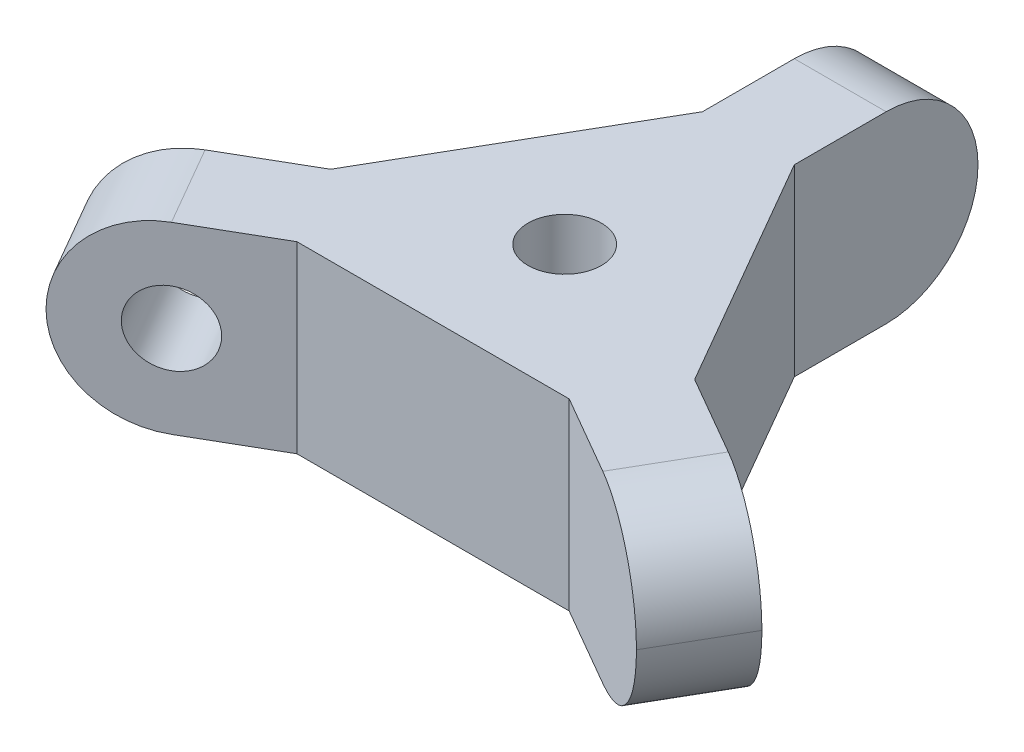
ISO-10303-21;
HEADER;
FILE_DESCRIPTION(('STEP AP214'),'2;1');
FILE_NAME('part.step','',(''),(''),'','','');
FILE_SCHEMA(('AUTOMOTIVE_DESIGN { 1 0 10303 214 1 1 1 1 }'));
ENDSEC;
DATA;
#1=APPLICATION_CONTEXT('core data for automotive mechanical design processes');
#2=APPLICATION_PROTOCOL_DEFINITION('international standard','automotive_design',2000,#1);
#3=PRODUCT_CONTEXT('',#1,'mechanical');
#4=PRODUCT('Part','Part','',(#3));
#5=PRODUCT_RELATED_PRODUCT_CATEGORY('part','',(#4));
#6=PRODUCT_DEFINITION_FORMATION('','',#4);
#7=PRODUCT_DEFINITION_CONTEXT('part definition',#1,'design');
#8=PRODUCT_DEFINITION('design','',#6,#7);
#9=PRODUCT_DEFINITION_SHAPE('','',#8);
#10=(LENGTH_UNIT() NAMED_UNIT(*) SI_UNIT(.MILLI.,.METRE.));
#11=(NAMED_UNIT(*) PLANE_ANGLE_UNIT() SI_UNIT($,.RADIAN.));
#12=(NAMED_UNIT(*) SI_UNIT($,.STERADIAN.) SOLID_ANGLE_UNIT());
#13=UNCERTAINTY_MEASURE_WITH_UNIT(LENGTH_MEASURE(1.E-05),#10,'distance_accuracy_value','');
#14=(GEOMETRIC_REPRESENTATION_CONTEXT(3) GLOBAL_UNCERTAINTY_ASSIGNED_CONTEXT((#13)) GLOBAL_UNIT_ASSIGNED_CONTEXT((#10,
#11,#12)) REPRESENTATION_CONTEXT('',''));
#15=CARTESIAN_POINT('',(0.,0.,0.));
#16=DIRECTION('',(0.,0.,1.));
#17=DIRECTION('',(1.,0.,0.));
#18=AXIS2_PLACEMENT_3D('',#15,#16,#17);
#19=CARTESIAN_POINT('',(0.,6.35,4.5498153285078));
#20=DIRECTION('',(0.,0.,-1.));
#21=DIRECTION('',(-1.,0.,0.));
#22=AXIS2_PLACEMENT_3D('',#19,#20,#21);
#23=PLANE('',#22);
#24=DIRECTION('',(1.,0.,0.));
#25=VECTOR('',#24,1.);
#26=CARTESIAN_POINT('',(0.,0.,4.5498153285078));
#27=LINE('',#26,#25);
#28=CARTESIAN_POINT('',(-4.70551131403119,0.,4.5498153285078));
#29=VERTEX_POINT('',#28);
#30=CARTESIAN_POINT('',(4.70551131403118,0.,4.5498153285078));
#31=VERTEX_POINT('',#30);
#32=EDGE_CURVE('E173',#29,#31,#27,.T.);
#33=ORIENTED_EDGE('',*,*,#32,.T.);
#34=DIRECTION('',(0.,-1.,0.));
#35=VECTOR('',#34,1.);
#36=CARTESIAN_POINT('',(4.70551131403118,6.35,4.5498153285078));
#37=LINE('',#36,#35);
#38=CARTESIAN_POINT('',(4.70551131403118,6.35,4.5498153285078));
#39=VERTEX_POINT('',#38);
#40=EDGE_CURVE('E152',#39,#31,#37,.T.);
#41=ORIENTED_EDGE('',*,*,#40,.F.);
#42=DIRECTION('',(1.,0.,0.));
#43=VECTOR('',#42,1.);
#44=CARTESIAN_POINT('',(0.,6.35,4.5498153285078));
#45=LINE('',#44,#43);
#46=CARTESIAN_POINT('',(-4.70551131403119,6.35,4.5498153285078));
#47=VERTEX_POINT('',#46);
#48=EDGE_CURVE('E160',#47,#39,#45,.T.);
#49=ORIENTED_EDGE('',*,*,#48,.F.);
#50=DIRECTION('',(0.,-1.,0.));
#51=VECTOR('',#50,1.);
#52=CARTESIAN_POINT('',(-4.70551131403119,6.35,4.5498153285078));
#53=LINE('',#52,#51);
#54=EDGE_CURVE('E265',#47,#29,#53,.T.);
#55=ORIENTED_EDGE('',*,*,#54,.T.);
#56=EDGE_LOOP('',(#33,#41,#49,#55));
#57=FACE_BOUND('',#56,.T.);
#58=ADVANCED_FACE('F38',(#57),#23,.F.);
#59=CARTESIAN_POINT('',(-0.79375,6.35,1.3748153285078));
#60=DIRECTION('',(0.5,0.,-0.866025403784438));
#61=DIRECTION('',(-0.866025403784439,0.,-0.5));
#62=AXIS2_PLACEMENT_3D('',#59,#60,#61);
#63=PLANE('',#62);
#64=DIRECTION('',(0.866025403784439,0.,0.5));
#65=VECTOR('',#64,1.);
#66=CARTESIAN_POINT('',(-0.79375,0.,1.3748153285078));
#67=LINE('',#66,#65);
#68=CARTESIAN_POINT('',(7.45514197104678,0.,6.1373153285078));
#69=VERTEX_POINT('',#68);
#70=EDGE_CURVE('E278',#31,#69,#67,.T.);
#71=ORIENTED_EDGE('',*,*,#70,.T.);
#72=CARTESIAN_POINT('',(7.45514197104678,3.175,6.1373153285078));
#73=DIRECTION('',(0.5,0.,-0.866025403784438));
#74=DIRECTION('',(-0.866025403784439,0.,-0.5));
#75=AXIS2_PLACEMENT_3D('',#72,#73,#74);
#76=CIRCLE('',#75,3.175);
#77=CARTESIAN_POINT('',(10.2047726280624,3.175,7.7248153285078));
#78=VERTEX_POINT('',#77);
#79=EDGE_CURVE('E224',#69,#78,#76,.F.);
#80=ORIENTED_EDGE('',*,*,#79,.T.);
#81=CARTESIAN_POINT('',(7.45514197104678,3.175,6.1373153285078));
#82=DIRECTION('',(0.5,0.,-0.866025403784438));
#83=DIRECTION('',(-0.866025403784439,0.,-0.5));
#84=AXIS2_PLACEMENT_3D('',#81,#82,#83);
#85=CIRCLE('',#84,3.175);
#86=CARTESIAN_POINT('',(7.45514197104678,6.35,6.1373153285078));
#87=VERTEX_POINT('',#86);
#88=EDGE_CURVE('E155',#78,#87,#85,.F.);
#89=ORIENTED_EDGE('',*,*,#88,.T.);
#90=DIRECTION('',(0.866025403784439,0.,0.5));
#91=VECTOR('',#90,1.);
#92=CARTESIAN_POINT('',(-0.79375,6.35,1.3748153285078));
#93=LINE('',#92,#91);
#94=EDGE_CURVE('E147',#39,#87,#93,.T.);
#95=ORIENTED_EDGE('',*,*,#94,.F.);
#96=ORIENTED_EDGE('',*,*,#40,.T.);
#97=EDGE_LOOP('',(#71,#80,#89,#95,#96));
#98=FACE_BOUND('',#97,.T.);
#99=ADVANCED_FACE('F150',(#98),#63,.F.);
#100=CARTESIAN_POINT('',(0.793749999999999,6.35,-1.3748153285078));
#101=DIRECTION('',(-0.5,0.,0.866025403784439));
#102=DIRECTION('',(0.866025403784439,0.,0.5));
#103=AXIS2_PLACEMENT_3D('',#100,#101,#102);
#104=PLANE('',#103);
#105=CARTESIAN_POINT('',(9.04264197104678,3.175,3.3876846714922));
#106=DIRECTION('',(-0.5,0.,0.866025403784439));
#107=DIRECTION('',(0.866025403784439,0.,0.5));
#108=AXIS2_PLACEMENT_3D('',#105,#106,#107);
#109=CIRCLE('',#108,3.175);
#110=CARTESIAN_POINT('',(9.04264197104678,6.35,3.38768467149221));
#111=VERTEX_POINT('',#110);
#112=CARTESIAN_POINT('',(11.7922726280624,3.175,4.9751846714922));
#113=VERTEX_POINT('',#112);
#114=EDGE_CURVE('E216',#111,#113,#109,.F.);
#115=ORIENTED_EDGE('',*,*,#114,.T.);
#116=CARTESIAN_POINT('',(9.04264197104678,3.175,3.3876846714922));
#117=DIRECTION('',(-0.5,0.,0.866025403784439));
#118=DIRECTION('',(0.866025403784439,0.,0.5));
#119=AXIS2_PLACEMENT_3D('',#116,#117,#118);
#120=CIRCLE('',#119,3.175);
#121=CARTESIAN_POINT('',(9.04264197104678,0.,3.38768467149221));
#122=VERTEX_POINT('',#121);
#123=EDGE_CURVE('E219',#113,#122,#120,.F.);
#124=ORIENTED_EDGE('',*,*,#123,.T.);
#125=DIRECTION('',(-0.866025403784439,0.,-0.5));
#126=VECTOR('',#125,1.);
#127=CARTESIAN_POINT('',(0.793749999999999,0.,-1.3748153285078));
#128=LINE('',#127,#126);
#129=CARTESIAN_POINT('',(6.29301131403118,0.,1.8001846714922));
#130=VERTEX_POINT('',#129);
#131=EDGE_CURVE('E281',#122,#130,#128,.T.);
#132=ORIENTED_EDGE('',*,*,#131,.T.);
#133=DIRECTION('',(0.,-1.,0.));
#134=VECTOR('',#133,1.);
#135=CARTESIAN_POINT('',(6.29301131403118,6.35,1.8001846714922));
#136=LINE('',#135,#134);
#137=CARTESIAN_POINT('',(6.29301131403118,6.35,1.8001846714922));
#138=VERTEX_POINT('',#137);
#139=EDGE_CURVE('E176',#138,#130,#136,.T.);
#140=ORIENTED_EDGE('',*,*,#139,.F.);
#141=DIRECTION('',(-0.866025403784439,0.,-0.5));
#142=VECTOR('',#141,1.);
#143=CARTESIAN_POINT('',(0.793749999999999,6.35,-1.3748153285078));
#144=LINE('',#143,#142);
#145=EDGE_CURVE('E159',#111,#138,#144,.T.);
#146=ORIENTED_EDGE('',*,*,#145,.F.);
#147=EDGE_LOOP('',(#115,#124,#132,#140,#146));
#148=FACE_BOUND('',#147,.T.);
#149=ADVANCED_FACE('F386',(#148),#104,.F.);
#150=CARTESIAN_POINT('',(3.94025565701559,6.35,-2.2749076642539));
#151=DIRECTION('',(-0.866025403784439,0.,0.5));
#152=DIRECTION('',(0.5,0.,0.866025403784439));
#153=AXIS2_PLACEMENT_3D('',#150,#151,#152);
#154=PLANE('',#153);
#155=DIRECTION('',(-0.5,0.,-0.866025403784439));
#156=VECTOR('',#155,1.);
#157=CARTESIAN_POINT('',(3.94025565701559,0.,-2.2749076642539));
#158=LINE('',#157,#156);
#159=CARTESIAN_POINT('',(1.5875,0.,-6.35));
#160=VERTEX_POINT('',#159);
#161=EDGE_CURVE('E284',#130,#160,#158,.T.);
#162=ORIENTED_EDGE('',*,*,#161,.T.);
#163=DIRECTION('',(0.,-1.,0.));
#164=VECTOR('',#163,1.);
#165=CARTESIAN_POINT('',(1.5875,6.35,-6.35));
#166=LINE('',#165,#164);
#167=CARTESIAN_POINT('',(1.5875,6.35,-6.35));
#168=VERTEX_POINT('',#167);
#169=EDGE_CURVE('E183',#168,#160,#166,.T.);
#170=ORIENTED_EDGE('',*,*,#169,.F.);
#171=DIRECTION('',(-0.5,0.,-0.866025403784439));
#172=VECTOR('',#171,1.);
#173=CARTESIAN_POINT('',(3.94025565701559,6.35,-2.2749076642539));
#174=LINE('',#173,#172);
#175=EDGE_CURVE('E340',#138,#168,#174,.T.);
#176=ORIENTED_EDGE('',*,*,#175,.F.);
#177=ORIENTED_EDGE('',*,*,#139,.T.);
#178=EDGE_LOOP('',(#162,#170,#176,#177));
#179=FACE_BOUND('',#178,.T.);
#180=ADVANCED_FACE('F323',(#179),#154,.F.);
#181=CARTESIAN_POINT('',(1.5875,6.35,0.));
#182=DIRECTION('',(1.,0.,0.));
#183=DIRECTION('',(0.,0.,-1.));
#184=AXIS2_PLACEMENT_3D('',#181,#182,#183);
#185=PLANE('',#184);
#186=CARTESIAN_POINT('',(1.5875,3.175,-9.525));
#187=DIRECTION('',(1.,0.,0.));
#188=DIRECTION('',(0.,0.,-1.));
#189=AXIS2_PLACEMENT_3D('',#186,#187,#188);
#190=CIRCLE('',#189,3.175);
#191=CARTESIAN_POINT('',(1.5875,0.,-9.525));
#192=VERTEX_POINT('',#191);
#193=CARTESIAN_POINT('',(1.5875,3.175,-12.7));
#194=VERTEX_POINT('',#193);
#195=EDGE_CURVE('E175',#192,#194,#190,.T.);
#196=ORIENTED_EDGE('',*,*,#195,.T.);
#197=CARTESIAN_POINT('',(1.5875,3.175,-9.525));
#198=DIRECTION('',(1.,0.,0.));
#199=DIRECTION('',(0.,0.,-1.));
#200=AXIS2_PLACEMENT_3D('',#197,#198,#199);
#201=CIRCLE('',#200,3.175);
#202=CARTESIAN_POINT('',(1.5875,6.35,-9.525));
#203=VERTEX_POINT('',#202);
#204=EDGE_CURVE('E180',#194,#203,#201,.T.);
#205=ORIENTED_EDGE('',*,*,#204,.T.);
#206=DIRECTION('',(0.,0.,1.));
#207=VECTOR('',#206,1.);
#208=CARTESIAN_POINT('',(1.5875,6.35,0.));
#209=LINE('',#208,#207);
#210=EDGE_CURVE('E318',#203,#168,#209,.T.);
#211=ORIENTED_EDGE('',*,*,#210,.T.);
#212=ORIENTED_EDGE('',*,*,#169,.T.);
#213=DIRECTION('',(0.,0.,1.));
#214=VECTOR('',#213,1.);
#215=CARTESIAN_POINT('',(1.5875,0.,0.));
#216=LINE('',#215,#214);
#217=EDGE_CURVE('E288',#192,#160,#216,.T.);
#218=ORIENTED_EDGE('',*,*,#217,.F.);
#219=EDGE_LOOP('',(#196,#205,#211,#212,#218));
#220=FACE_BOUND('',#219,.T.);
#221=ADVANCED_FACE('F316',(#220),#185,.T.);
#222=CARTESIAN_POINT('',(-1.5875,6.35,0.));
#223=DIRECTION('',(-1.,0.,0.));
#224=DIRECTION('',(0.,0.,1.));
#225=AXIS2_PLACEMENT_3D('',#222,#223,#224);
#226=PLANE('',#225);
#227=DIRECTION('',(0.,0.,-1.));
#228=VECTOR('',#227,1.);
#229=CARTESIAN_POINT('',(-1.5875,6.35,0.));
#230=LINE('',#229,#228);
#231=CARTESIAN_POINT('',(-1.5875,6.35,-6.35));
#232=VERTEX_POINT('',#231);
#233=CARTESIAN_POINT('',(-1.5875,6.35,-9.525));
#234=VERTEX_POINT('',#233);
#235=EDGE_CURVE('E267',#232,#234,#230,.T.);
#236=ORIENTED_EDGE('',*,*,#235,.T.);
#237=CARTESIAN_POINT('',(-1.5875,3.175,-9.525));
#238=DIRECTION('',(-1.,0.,0.));
#239=DIRECTION('',(0.,0.,1.));
#240=AXIS2_PLACEMENT_3D('',#237,#238,#239);
#241=CIRCLE('',#240,3.175);
#242=CARTESIAN_POINT('',(-1.5875,3.175,-12.7));
#243=VERTEX_POINT('',#242);
#244=EDGE_CURVE('E202',#234,#243,#241,.T.);
#245=ORIENTED_EDGE('',*,*,#244,.T.);
#246=CARTESIAN_POINT('',(-1.5875,3.175,-9.525));
#247=DIRECTION('',(-1.,0.,0.));
#248=DIRECTION('',(0.,0.,1.));
#249=AXIS2_PLACEMENT_3D('',#246,#247,#248);
#250=CIRCLE('',#249,3.175);
#251=CARTESIAN_POINT('',(-1.5875,0.,-9.525));
#252=VERTEX_POINT('',#251);
#253=EDGE_CURVE('E199',#243,#252,#250,.T.);
#254=ORIENTED_EDGE('',*,*,#253,.T.);
#255=DIRECTION('',(0.,0.,-1.));
#256=VECTOR('',#255,1.);
#257=CARTESIAN_POINT('',(-1.5875,0.,0.));
#258=LINE('',#257,#256);
#259=CARTESIAN_POINT('',(-1.5875,0.,-6.35));
#260=VERTEX_POINT('',#259);
#261=EDGE_CURVE('E291',#260,#252,#258,.T.);
#262=ORIENTED_EDGE('',*,*,#261,.F.);
#263=DIRECTION('',(0.,-1.,0.));
#264=VECTOR('',#263,1.);
#265=CARTESIAN_POINT('',(-1.5875,6.35,-6.35));
#266=LINE('',#265,#264);
#267=EDGE_CURVE('E309',#232,#260,#266,.T.);
#268=ORIENTED_EDGE('',*,*,#267,.F.);
#269=EDGE_LOOP('',(#236,#245,#254,#262,#268));
#270=FACE_BOUND('',#269,.T.);
#271=ADVANCED_FACE('F345',(#270),#226,.T.);
#272=CARTESIAN_POINT('',(-3.94025565701559,6.35,-2.2749076642539));
#273=DIRECTION('',(0.866025403784439,0.,0.5));
#274=DIRECTION('',(0.5,0.,-0.866025403784439));
#275=AXIS2_PLACEMENT_3D('',#272,#273,#274);
#276=PLANE('',#275);
#277=DIRECTION('',(-0.5,0.,0.866025403784439));
#278=VECTOR('',#277,1.);
#279=CARTESIAN_POINT('',(-3.94025565701559,0.,-2.2749076642539));
#280=LINE('',#279,#278);
#281=CARTESIAN_POINT('',(-6.29301131403119,0.,1.8001846714922));
#282=VERTEX_POINT('',#281);
#283=EDGE_CURVE('E295',#260,#282,#280,.T.);
#284=ORIENTED_EDGE('',*,*,#283,.T.);
#285=DIRECTION('',(0.,-1.,0.));
#286=VECTOR('',#285,1.);
#287=CARTESIAN_POINT('',(-6.29301131403119,6.35,1.8001846714922));
#288=LINE('',#287,#286);
#289=CARTESIAN_POINT('',(-6.29301131403119,6.35,1.8001846714922));
#290=VERTEX_POINT('',#289);
#291=EDGE_CURVE('E306',#290,#282,#288,.T.);
#292=ORIENTED_EDGE('',*,*,#291,.F.);
#293=DIRECTION('',(-0.5,0.,0.866025403784439));
#294=VECTOR('',#293,1.);
#295=CARTESIAN_POINT('',(-3.94025565701559,6.35,-2.2749076642539));
#296=LINE('',#295,#294);
#297=EDGE_CURVE('E259',#232,#290,#296,.T.);
#298=ORIENTED_EDGE('',*,*,#297,.F.);
#299=ORIENTED_EDGE('',*,*,#267,.T.);
#300=EDGE_LOOP('',(#284,#292,#298,#299));
#301=FACE_BOUND('',#300,.T.);
#302=ADVANCED_FACE('F461',(#301),#276,.F.);
#303=CARTESIAN_POINT('',(-0.793749999999997,6.35,-1.37481532850779));
#304=DIRECTION('',(0.499999999999999,0.,0.866025403784439));
#305=DIRECTION('',(0.866025403784439,0.,-0.5));
#306=AXIS2_PLACEMENT_3D('',#303,#304,#305);
#307=PLANE('',#306);
#308=CARTESIAN_POINT('',(-9.04264197104678,3.175,3.38768467149221));
#309=DIRECTION('',(0.499999999999999,0.,0.866025403784439));
#310=DIRECTION('',(0.866025403784439,0.,-0.5));
#311=AXIS2_PLACEMENT_3D('',#308,#309,#310);
#312=CIRCLE('',#311,1.27);
#313=CARTESIAN_POINT('',(-7.94278970824054,3.175,2.75268467149221));
#314=VERTEX_POINT('',#313);
#315=EDGE_CURVE('E275',#314,#314,#312,.F.);
#316=ORIENTED_EDGE('',*,*,#315,.F.);
#317=EDGE_LOOP('',(#316));
#318=FACE_BOUND('',#317,.T.);
#319=DIRECTION('',(-0.866025403784439,0.,0.5));
#320=VECTOR('',#319,1.);
#321=CARTESIAN_POINT('',(-0.793749999999997,0.,-1.37481532850779));
#322=LINE('',#321,#320);
#323=CARTESIAN_POINT('',(-9.04264197104678,0.,3.38768467149221));
#324=VERTEX_POINT('',#323);
#325=EDGE_CURVE('E298',#282,#324,#322,.T.);
#326=ORIENTED_EDGE('',*,*,#325,.T.);
#327=CARTESIAN_POINT('',(-9.04264197104678,3.175,3.3876846714922));
#328=DIRECTION('',(0.499999999999999,0.,0.866025403784439));
#329=DIRECTION('',(0.866025403784439,0.,-0.5));
#330=AXIS2_PLACEMENT_3D('',#327,#328,#329);
#331=CIRCLE('',#330,3.175);
#332=CARTESIAN_POINT('',(-11.7922726280624,3.175,4.9751846714922));
#333=VERTEX_POINT('',#332);
#334=EDGE_CURVE('E11',#324,#333,#331,.F.);
#335=ORIENTED_EDGE('',*,*,#334,.T.);
#336=CARTESIAN_POINT('',(-9.04264197104678,3.175,3.3876846714922));
#337=DIRECTION('',(0.499999999999999,0.,0.866025403784439));
#338=DIRECTION('',(0.866025403784439,0.,-0.5));
#339=AXIS2_PLACEMENT_3D('',#336,#337,#338);
#340=CIRCLE('',#339,3.175);
#341=CARTESIAN_POINT('',(-9.04264197104678,6.35,3.38768467149221));
#342=VERTEX_POINT('',#341);
#343=EDGE_CURVE('E48',#333,#342,#340,.F.);
#344=ORIENTED_EDGE('',*,*,#343,.T.);
#345=DIRECTION('',(-0.866025403784439,0.,0.5));
#346=VECTOR('',#345,1.);
#347=CARTESIAN_POINT('',(-0.793749999999997,6.35,-1.37481532850779));
#348=LINE('',#347,#346);
#349=EDGE_CURVE('E256',#290,#342,#348,.T.);
#350=ORIENTED_EDGE('',*,*,#349,.F.);
#351=ORIENTED_EDGE('',*,*,#291,.T.);
#352=EDGE_LOOP('',(#326,#335,#344,#350,#351));
#353=FACE_BOUND('',#352,.T.);
#354=ADVANCED_FACE('F254',(#318,#353),#307,.F.);
#355=CARTESIAN_POINT('',(0.,6.35,0.));
#356=DIRECTION('',(0.,-1.,0.));
#357=DIRECTION('',(0.,0.,-1.));
#358=AXIS2_PLACEMENT_3D('',#355,#356,#357);
#359=CYLINDRICAL_SURFACE('',#358,1.27);
#360=CARTESIAN_POINT('',(0.,6.35,0.));
#361=DIRECTION('',(0.,1.,0.));
#362=DIRECTION('',(0.,0.,1.));
#363=AXIS2_PLACEMENT_3D('',#360,#361,#362);
#364=CIRCLE('',#363,1.27);
#365=CARTESIAN_POINT('',(0.,6.35,1.27));
#366=VERTEX_POINT('',#365);
#367=EDGE_CURVE('E170',#366,#366,#364,.T.);
#368=ORIENTED_EDGE('',*,*,#367,.T.);
#369=EDGE_LOOP('',(#368));
#370=FACE_BOUND('',#369,.T.);
#371=CARTESIAN_POINT('',(0.,0.,0.));
#372=DIRECTION('',(0.,1.,0.));
#373=DIRECTION('',(0.,0.,1.));
#374=AXIS2_PLACEMENT_3D('',#371,#372,#373);
#375=CIRCLE('',#374,1.27);
#376=CARTESIAN_POINT('',(0.,0.,1.27));
#377=VERTEX_POINT('',#376);
#378=EDGE_CURVE('E271',#377,#377,#375,.T.);
#379=ORIENTED_EDGE('',*,*,#378,.F.);
#380=EDGE_LOOP('',(#379));
#381=FACE_BOUND('',#380,.T.);
#382=ADVANCED_FACE('F367',(#370,#381),#359,.F.);
#383=CARTESIAN_POINT('',(0.79375,6.35,1.37481532850779));
#384=DIRECTION('',(-0.5,0.,-0.866025403784438));
#385=DIRECTION('',(-0.866025403784438,0.,0.5));
#386=AXIS2_PLACEMENT_3D('',#383,#384,#385);
#387=PLANE('',#386);
#388=CARTESIAN_POINT('',(-7.45514197104678,3.175,6.1373153285078));
#389=DIRECTION('',(0.500000000000001,0.,0.866025403784438));
#390=DIRECTION('',(0.866025403784438,0.,-0.500000000000001));
#391=AXIS2_PLACEMENT_3D('',#388,#389,#390);
#392=CIRCLE('',#391,1.27);
#393=CARTESIAN_POINT('',(-6.35528970824054,3.175,5.5023153285078));
#394=VERTEX_POINT('',#393);
#395=EDGE_CURVE('E237',#394,#394,#392,.T.);
#396=ORIENTED_EDGE('',*,*,#395,.F.);
#397=EDGE_LOOP('',(#396));
#398=FACE_BOUND('',#397,.T.);
#399=CARTESIAN_POINT('',(-7.45514197104678,3.175,6.1373153285078));
#400=DIRECTION('',(-0.5,0.,-0.866025403784438));
#401=DIRECTION('',(-0.866025403784438,0.,0.5));
#402=AXIS2_PLACEMENT_3D('',#399,#400,#401);
#403=CIRCLE('',#402,3.175);
#404=CARTESIAN_POINT('',(-7.45514197104678,6.35,6.1373153285078));
#405=VERTEX_POINT('',#404);
#406=CARTESIAN_POINT('',(-10.2047726280624,3.175,7.7248153285078));
#407=VERTEX_POINT('',#406);
#408=EDGE_CURVE('E62',#405,#407,#403,.F.);
#409=ORIENTED_EDGE('',*,*,#408,.T.);
#410=CARTESIAN_POINT('',(-7.45514197104678,3.175,6.1373153285078));
#411=DIRECTION('',(-0.5,0.,-0.866025403784438));
#412=DIRECTION('',(-0.866025403784438,0.,0.5));
#413=AXIS2_PLACEMENT_3D('',#410,#411,#412);
#414=CIRCLE('',#413,3.175);
#415=CARTESIAN_POINT('',(-7.45514197104678,0.,6.1373153285078));
#416=VERTEX_POINT('',#415);
#417=EDGE_CURVE('E229',#407,#416,#414,.F.);
#418=ORIENTED_EDGE('',*,*,#417,.T.);
#419=DIRECTION('',(0.866025403784438,0.,-0.5));
#420=VECTOR('',#419,1.);
#421=CARTESIAN_POINT('',(0.79375,0.,1.37481532850779));
#422=LINE('',#421,#420);
#423=EDGE_CURVE('E301',#416,#29,#422,.T.);
#424=ORIENTED_EDGE('',*,*,#423,.T.);
#425=ORIENTED_EDGE('',*,*,#54,.F.);
#426=DIRECTION('',(0.866025403784438,0.,-0.5));
#427=VECTOR('',#426,1.);
#428=CARTESIAN_POINT('',(0.79375,6.35,1.37481532850779));
#429=LINE('',#428,#427);
#430=EDGE_CURVE('E165',#405,#47,#429,.T.);
#431=ORIENTED_EDGE('',*,*,#430,.F.);
#432=EDGE_LOOP('',(#409,#418,#424,#425,#431));
#433=FACE_BOUND('',#432,.T.);
#434=ADVANCED_FACE('F365',(#398,#433),#387,.F.);
#435=CARTESIAN_POINT('',(0.,6.35,0.));
#436=DIRECTION('',(0.,1.,0.));
#437=DIRECTION('',(0.,0.,1.));
#438=AXIS2_PLACEMENT_3D('',#435,#436,#437);
#439=PLANE('',#438);
#440=ORIENTED_EDGE('',*,*,#367,.F.);
#441=EDGE_LOOP('',(#440));
#442=FACE_BOUND('',#441,.T.);
#443=ORIENTED_EDGE('',*,*,#210,.F.);
#444=DIRECTION('',(1.,0.,0.));
#445=VECTOR('',#444,1.);
#446=CARTESIAN_POINT('',(0.,6.35,-9.525));
#447=LINE('',#446,#445);
#448=EDGE_CURVE('E195',#203,#234,#447,.F.);
#449=ORIENTED_EDGE('',*,*,#448,.T.);
#450=ORIENTED_EDGE('',*,*,#235,.F.);
#451=ORIENTED_EDGE('',*,*,#297,.T.);
#452=ORIENTED_EDGE('',*,*,#349,.T.);
#453=DIRECTION('',(0.5,0.,0.866025403784439));
#454=VECTOR('',#453,1.);
#455=CARTESIAN_POINT('',(-7.45514197104678,6.35,6.1373153285078));
#456=LINE('',#455,#454);
#457=EDGE_CURVE('E189',#342,#405,#456,.T.);
#458=ORIENTED_EDGE('',*,*,#457,.T.);
#459=ORIENTED_EDGE('',*,*,#430,.T.);
#460=ORIENTED_EDGE('',*,*,#48,.T.);
#461=ORIENTED_EDGE('',*,*,#94,.T.);
#462=DIRECTION('',(0.5,0.,-0.866025403784439));
#463=VECTOR('',#462,1.);
#464=CARTESIAN_POINT('',(9.04264197104678,6.35,3.38768467149221));
#465=LINE('',#464,#463);
#466=EDGE_CURVE('E192',#87,#111,#465,.T.);
#467=ORIENTED_EDGE('',*,*,#466,.T.);
#468=ORIENTED_EDGE('',*,*,#145,.T.);
#469=ORIENTED_EDGE('',*,*,#175,.T.);
#470=EDGE_LOOP('',(#443,#449,#450,#451,#452,#458,#459,#460,#461,#467,#468,#469));
#471=FACE_BOUND('',#470,.T.);
#472=ADVANCED_FACE('F164',(#442,#471),#439,.T.);
#473=CARTESIAN_POINT('',(0.,0.,0.));
#474=DIRECTION('',(0.,1.,0.));
#475=DIRECTION('',(0.,0.,1.));
#476=AXIS2_PLACEMENT_3D('',#473,#474,#475);
#477=PLANE('',#476);
#478=ORIENTED_EDGE('',*,*,#378,.T.);
#479=EDGE_LOOP('',(#478));
#480=FACE_BOUND('',#479,.T.);
#481=ORIENTED_EDGE('',*,*,#261,.T.);
#482=DIRECTION('',(1.,0.,0.));
#483=VECTOR('',#482,1.);
#484=CARTESIAN_POINT('',(1.5875,0.,-9.525));
#485=LINE('',#484,#483);
#486=EDGE_CURVE('E213',#252,#192,#485,.T.);
#487=ORIENTED_EDGE('',*,*,#486,.T.);
#488=ORIENTED_EDGE('',*,*,#217,.T.);
#489=ORIENTED_EDGE('',*,*,#161,.F.);
#490=ORIENTED_EDGE('',*,*,#131,.F.);
#491=DIRECTION('',(0.5,0.,-0.866025403784439));
#492=VECTOR('',#491,1.);
#493=CARTESIAN_POINT('',(8.24889197104678,0.,4.7625));
#494=LINE('',#493,#492);
#495=EDGE_CURVE('E209',#122,#69,#494,.F.);
#496=ORIENTED_EDGE('',*,*,#495,.T.);
#497=ORIENTED_EDGE('',*,*,#70,.F.);
#498=ORIENTED_EDGE('',*,*,#32,.F.);
#499=ORIENTED_EDGE('',*,*,#423,.F.);
#500=DIRECTION('',(0.5,0.,0.866025403784439));
#501=VECTOR('',#500,1.);
#502=CARTESIAN_POINT('',(-8.24889197104678,0.,4.7625));
#503=LINE('',#502,#501);
#504=EDGE_CURVE('E205',#416,#324,#503,.F.);
#505=ORIENTED_EDGE('',*,*,#504,.T.);
#506=ORIENTED_EDGE('',*,*,#325,.F.);
#507=ORIENTED_EDGE('',*,*,#283,.F.);
#508=EDGE_LOOP('',(#481,#487,#488,#489,#490,#496,#497,#498,#499,#505,#506,#507));
#509=FACE_BOUND('',#508,.T.);
#510=ADVANCED_FACE('F327',(#480,#509),#477,.F.);
#511=CARTESIAN_POINT('',(-16.6969044547955,3.175,-9.86988684482883));
#512=DIRECTION('',(0.500000000000001,0.,0.866025403784438));
#513=DIRECTION('',(0.866025403784438,0.,-0.500000000000001));
#514=AXIS2_PLACEMENT_3D('',#511,#512,#513);
#515=CYLINDRICAL_SURFACE('',#514,1.27);
#516=ORIENTED_EDGE('',*,*,#395,.T.);
#517=EDGE_LOOP('',(#516));
#518=FACE_BOUND('',#517,.T.);
#519=ORIENTED_EDGE('',*,*,#315,.T.);
#520=EDGE_LOOP('',(#519));
#521=FACE_BOUND('',#520,.T.);
#522=ADVANCED_FACE('F362',(#518,#521),#515,.F.);
#523=CARTESIAN_POINT('',(0.,3.175,-9.525));
#524=DIRECTION('',(-1.,0.,0.));
#525=DIRECTION('',(0.,0.,1.));
#526=AXIS2_PLACEMENT_3D('',#523,#524,#525);
#527=CYLINDRICAL_SURFACE('',#526,3.175);
#528=ORIENTED_EDGE('',*,*,#486,.F.);
#529=ORIENTED_EDGE('',*,*,#253,.F.);
#530=DIRECTION('',(1.,0.,0.));
#531=VECTOR('',#530,1.);
#532=CARTESIAN_POINT('',(-1.5875,3.175,-12.7));
#533=LINE('',#532,#531);
#534=EDGE_CURVE('E234',#194,#243,#533,.F.);
#535=ORIENTED_EDGE('',*,*,#534,.F.);
#536=ORIENTED_EDGE('',*,*,#195,.F.);
#537=EDGE_LOOP('',(#528,#529,#535,#536));
#538=FACE_BOUND('',#537,.T.);
#539=ADVANCED_FACE('F334',(#538),#527,.T.);
#540=CARTESIAN_POINT('',(0.,3.175,-9.525));
#541=DIRECTION('',(1.,0.,0.));
#542=DIRECTION('',(0.,0.,-1.));
#543=AXIS2_PLACEMENT_3D('',#540,#541,#542);
#544=CYLINDRICAL_SURFACE('',#543,3.175);
#545=ORIENTED_EDGE('',*,*,#244,.F.);
#546=ORIENTED_EDGE('',*,*,#448,.F.);
#547=ORIENTED_EDGE('',*,*,#204,.F.);
#548=ORIENTED_EDGE('',*,*,#534,.T.);
#549=EDGE_LOOP('',(#545,#546,#547,#548));
#550=FACE_BOUND('',#549,.T.);
#551=ADVANCED_FACE('F343',(#550),#544,.T.);
#552=CARTESIAN_POINT('',(8.24889197104678,3.175,4.7625));
#553=DIRECTION('',(-0.5,0.,0.866025403784439));
#554=DIRECTION('',(0.866025403784439,0.,0.5));
#555=AXIS2_PLACEMENT_3D('',#552,#553,#554);
#556=CYLINDRICAL_SURFACE('',#555,3.175);
#557=ORIENTED_EDGE('',*,*,#466,.F.);
#558=ORIENTED_EDGE('',*,*,#88,.F.);
#559=DIRECTION('',(0.5,0.,-0.866025403784439));
#560=VECTOR('',#559,1.);
#561=CARTESIAN_POINT('',(10.2047726280624,3.175,7.7248153285078));
#562=LINE('',#561,#560);
#563=EDGE_CURVE('E238',#113,#78,#562,.F.);
#564=ORIENTED_EDGE('',*,*,#563,.F.);
#565=ORIENTED_EDGE('',*,*,#114,.F.);
#566=EDGE_LOOP('',(#557,#558,#564,#565));
#567=FACE_BOUND('',#566,.T.);
#568=ADVANCED_FACE('F392',(#567),#556,.T.);
#569=CARTESIAN_POINT('',(8.24889197104678,3.175,4.7625));
#570=DIRECTION('',(0.5,0.,-0.866025403784439));
#571=DIRECTION('',(-0.866025403784439,0.,-0.5));
#572=AXIS2_PLACEMENT_3D('',#569,#570,#571);
#573=CYLINDRICAL_SURFACE('',#572,3.175);
#574=ORIENTED_EDGE('',*,*,#79,.F.);
#575=ORIENTED_EDGE('',*,*,#495,.F.);
#576=ORIENTED_EDGE('',*,*,#123,.F.);
#577=ORIENTED_EDGE('',*,*,#563,.T.);
#578=EDGE_LOOP('',(#574,#575,#576,#577));
#579=FACE_BOUND('',#578,.T.);
#580=ADVANCED_FACE('F395',(#579),#573,.T.);
#581=CARTESIAN_POINT('',(-8.24889197104678,3.175,4.7625));
#582=DIRECTION('',(-0.5,0.,-0.866025403784439));
#583=DIRECTION('',(-0.866025403784439,0.,0.5));
#584=AXIS2_PLACEMENT_3D('',#581,#582,#583);
#585=CYLINDRICAL_SURFACE('',#584,3.175);
#586=ORIENTED_EDGE('',*,*,#457,.F.);
#587=ORIENTED_EDGE('',*,*,#343,.F.);
#588=DIRECTION('',(0.5,0.,0.866025403784439));
#589=VECTOR('',#588,1.);
#590=CARTESIAN_POINT('',(-11.7922726280624,3.175,4.9751846714922));
#591=LINE('',#590,#589);
#592=EDGE_CURVE('E42',#407,#333,#591,.F.);
#593=ORIENTED_EDGE('',*,*,#592,.F.);
#594=ORIENTED_EDGE('',*,*,#408,.F.);
#595=EDGE_LOOP('',(#586,#587,#593,#594));
#596=FACE_BOUND('',#595,.T.);
#597=ADVANCED_FACE('F40',(#596),#585,.T.);
#598=CARTESIAN_POINT('',(-8.24889197104678,3.175,4.7625));
#599=DIRECTION('',(0.5,0.,0.866025403784439));
#600=DIRECTION('',(0.866025403784439,0.,-0.5));
#601=AXIS2_PLACEMENT_3D('',#598,#599,#600);
#602=CYLINDRICAL_SURFACE('',#601,3.175);
#603=ORIENTED_EDGE('',*,*,#334,.F.);
#604=ORIENTED_EDGE('',*,*,#504,.F.);
#605=ORIENTED_EDGE('',*,*,#417,.F.);
#606=ORIENTED_EDGE('',*,*,#592,.T.);
#607=EDGE_LOOP('',(#603,#604,#605,#606));
#608=FACE_BOUND('',#607,.T.);
#609=ADVANCED_FACE('F248',(#608),#602,.T.);
#610=CLOSED_SHELL('',(#58,#99,#149,#180,#221,#271,#302,#354,#382,#434,#472,#510,#522,#539,#551,
#568,#580,#597,#609));
#611=MANIFOLD_SOLID_BREP('B2',#610);
#612=ADVANCED_BREP_SHAPE_REPRESENTATION('',(#18,#611),#14);
#613=SHAPE_DEFINITION_REPRESENTATION(#9,#612);
ENDSEC;
END-ISO-10303-21;
